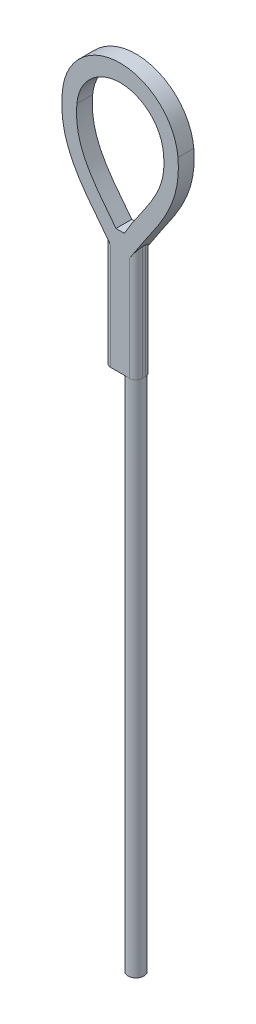
ISO-10303-21;
HEADER;
FILE_DESCRIPTION(('STEP AP214'),'2;1');
FILE_NAME('part.step','',(''),(''),'','','');
FILE_SCHEMA(('AUTOMOTIVE_DESIGN { 1 0 10303 214 1 1 1 1 }'));
ENDSEC;
DATA;
#1=APPLICATION_CONTEXT('core data for automotive mechanical design processes');
#2=APPLICATION_PROTOCOL_DEFINITION('international standard','automotive_design',2000,#1);
#3=PRODUCT_CONTEXT('',#1,'mechanical');
#4=PRODUCT('Part','Part','',(#3));
#5=PRODUCT_RELATED_PRODUCT_CATEGORY('part','',(#4));
#6=PRODUCT_DEFINITION_FORMATION('','',#4);
#7=PRODUCT_DEFINITION_CONTEXT('part definition',#1,'design');
#8=PRODUCT_DEFINITION('design','',#6,#7);
#9=PRODUCT_DEFINITION_SHAPE('','',#8);
#10=(LENGTH_UNIT() NAMED_UNIT(*) SI_UNIT(.MILLI.,.METRE.));
#11=(NAMED_UNIT(*) PLANE_ANGLE_UNIT() SI_UNIT($,.RADIAN.));
#12=(NAMED_UNIT(*) SI_UNIT($,.STERADIAN.) SOLID_ANGLE_UNIT());
#13=UNCERTAINTY_MEASURE_WITH_UNIT(LENGTH_MEASURE(1.E-05),#10,'distance_accuracy_value','');
#14=(GEOMETRIC_REPRESENTATION_CONTEXT(3) GLOBAL_UNCERTAINTY_ASSIGNED_CONTEXT((#13)) GLOBAL_UNIT_ASSIGNED_CONTEXT((#10,
#11,#12)) REPRESENTATION_CONTEXT('',''));
#15=CARTESIAN_POINT('',(0.,0.,0.));
#16=DIRECTION('',(0.,0.,1.));
#17=DIRECTION('',(1.,0.,0.));
#18=AXIS2_PLACEMENT_3D('',#15,#16,#17);
#19=CARTESIAN_POINT('',(0.,50.8,0.));
#20=DIRECTION('',(0.,-1.,0.));
#21=DIRECTION('',(0.,0.,-1.));
#22=AXIS2_PLACEMENT_3D('',#19,#20,#21);
#23=CYLINDRICAL_SURFACE('',#22,0.635);
#24=CARTESIAN_POINT('',(0.,0.,0.));
#25=DIRECTION('',(0.,1.,0.));
#26=DIRECTION('',(0.,0.,1.));
#27=AXIS2_PLACEMENT_3D('',#24,#25,#26);
#28=CIRCLE('',#27,0.635);
#29=CARTESIAN_POINT('',(0.,0.,0.635));
#30=VERTEX_POINT('',#29);
#31=EDGE_CURVE('E263',#30,#30,#28,.T.);
#32=ORIENTED_EDGE('',*,*,#31,.T.);
#33=EDGE_LOOP('',(#32));
#34=FACE_BOUND('',#33,.T.);
#35=CARTESIAN_POINT('',(0.,41.6415791346162,0.));
#36=DIRECTION('',(0.,1.,0.));
#37=DIRECTION('',(0.,0.,1.));
#38=AXIS2_PLACEMENT_3D('',#35,#36,#37);
#39=CIRCLE('',#38,0.635);
#40=CARTESIAN_POINT('',(0.635,41.6415791346162,0.));
#41=VERTEX_POINT('',#40);
#42=CARTESIAN_POINT('',(0.,41.6415791346162,-0.635));
#43=VERTEX_POINT('',#42);
#44=EDGE_CURVE('E268',#41,#43,#39,.T.);
#45=ORIENTED_EDGE('',*,*,#44,.F.);
#46=CARTESIAN_POINT('',(0.,41.6415791346162,0.635));
#47=VERTEX_POINT('',#46);
#48=EDGE_CURVE('E270',#47,#41,#39,.T.);
#49=ORIENTED_EDGE('',*,*,#48,.F.);
#50=EDGE_CURVE('E272',#43,#47,#39,.T.);
#51=ORIENTED_EDGE('',*,*,#50,.F.);
#52=EDGE_LOOP('',(#45,#49,#51));
#53=FACE_BOUND('',#52,.T.);
#54=ADVANCED_FACE('F33',(#34,#53),#23,.T.);
#55=CARTESIAN_POINT('',(0.,0.,0.));
#56=DIRECTION('',(0.,1.,0.));
#57=DIRECTION('',(0.,0.,1.));
#58=AXIS2_PLACEMENT_3D('',#55,#56,#57);
#59=PLANE('',#58);
#60=ORIENTED_EDGE('',*,*,#31,.F.);
#61=EDGE_LOOP('',(#60));
#62=FACE_BOUND('',#61,.T.);
#63=ADVANCED_FACE('F220',(#62),#59,.F.);
#64=CARTESIAN_POINT('',(0.,41.6415791346162,0.635));
#65=DIRECTION('',(0.,1.,0.));
#66=DIRECTION('',(0.,0.,1.));
#67=AXIS2_PLACEMENT_3D('',#64,#65,#66);
#68=PLANE('',#67);
#69=DIRECTION('',(0.,0.,-1.));
#70=VECTOR('',#69,1.);
#71=CARTESIAN_POINT('',(0.635,41.6415791346162,0.635));
#72=LINE('',#71,#70);
#73=CARTESIAN_POINT('',(0.635,41.6415791346162,0.127));
#74=VERTEX_POINT('',#73);
#75=EDGE_CURVE('E282',#74,#41,#72,.T.);
#76=ORIENTED_EDGE('',*,*,#75,.F.);
#77=CARTESIAN_POINT('',(0.127,41.6415791346162,0.127));
#78=DIRECTION('',(0.,1.,0.));
#79=DIRECTION('',(0.,0.,1.));
#80=AXIS2_PLACEMENT_3D('',#77,#78,#79);
#81=CIRCLE('',#80,0.508);
#82=CARTESIAN_POINT('',(0.127,41.6415791346162,0.635));
#83=VERTEX_POINT('',#82);
#84=EDGE_CURVE('E326',#74,#83,#81,.F.);
#85=ORIENTED_EDGE('',*,*,#84,.T.);
#86=DIRECTION('',(1.,0.,0.));
#87=VECTOR('',#86,1.);
#88=CARTESIAN_POINT('',(0.,41.6415791346162,0.635));
#89=LINE('',#88,#87);
#90=EDGE_CURVE('E204',#47,#83,#89,.T.);
#91=ORIENTED_EDGE('',*,*,#90,.F.);
#92=ORIENTED_EDGE('',*,*,#48,.T.);
#93=EDGE_LOOP('',(#76,#85,#91,#92));
#94=FACE_BOUND('',#93,.T.);
#95=ADVANCED_FACE('F258',(#94),#68,.F.);
#96=DIRECTION('',(1.,0.,0.));
#97=VECTOR('',#96,1.);
#98=CARTESIAN_POINT('',(0.,41.6415791346162,-0.635));
#99=LINE('',#98,#97);
#100=CARTESIAN_POINT('',(0.127,41.6415791346162,-0.635));
#101=VERTEX_POINT('',#100);
#102=EDGE_CURVE('E337',#43,#101,#99,.T.);
#103=ORIENTED_EDGE('',*,*,#102,.T.);
#104=CARTESIAN_POINT('',(0.127,41.6415791346162,-0.127));
#105=DIRECTION('',(0.,1.,0.));
#106=DIRECTION('',(0.,0.,1.));
#107=AXIS2_PLACEMENT_3D('',#104,#105,#106);
#108=CIRCLE('',#107,0.508);
#109=CARTESIAN_POINT('',(0.635,41.6415791346162,-0.127));
#110=VERTEX_POINT('',#109);
#111=EDGE_CURVE('E289',#101,#110,#108,.F.);
#112=ORIENTED_EDGE('',*,*,#111,.T.);
#113=EDGE_CURVE('E286',#41,#110,#72,.T.);
#114=ORIENTED_EDGE('',*,*,#113,.F.);
#115=ORIENTED_EDGE('',*,*,#44,.T.);
#116=EDGE_LOOP('',(#103,#112,#114,#115));
#117=FACE_BOUND('',#116,.T.);
#118=ADVANCED_FACE('F287',(#117),#68,.F.);
#119=CARTESIAN_POINT('',(0.635,0.,0.635));
#120=DIRECTION('',(-1.,0.,0.));
#121=DIRECTION('',(0.,0.,1.));
#122=AXIS2_PLACEMENT_3D('',#119,#120,#121);
#123=PLANE('',#122);
#124=ORIENTED_EDGE('',*,*,#113,.T.);
#125=DIRECTION('',(0.,1.,0.));
#126=VECTOR('',#125,1.);
#127=CARTESIAN_POINT('',(0.635,0.,-0.127));
#128=LINE('',#127,#126);
#129=CARTESIAN_POINT('',(0.635,50.8,-0.127));
#130=VERTEX_POINT('',#129);
#131=EDGE_CURVE('E319',#110,#130,#128,.T.);
#132=ORIENTED_EDGE('',*,*,#131,.T.);
#133=DIRECTION('',(0.,0.,-1.));
#134=VECTOR('',#133,1.);
#135=CARTESIAN_POINT('',(0.635,50.8,0.635));
#136=LINE('',#135,#134);
#137=CARTESIAN_POINT('',(0.635,50.8,0.127));
#138=VERTEX_POINT('',#137);
#139=EDGE_CURVE('E155',#138,#130,#136,.T.);
#140=ORIENTED_EDGE('',*,*,#139,.F.);
#141=DIRECTION('',(0.,1.,0.));
#142=VECTOR('',#141,1.);
#143=CARTESIAN_POINT('',(0.635,41.6415791346162,0.127));
#144=LINE('',#143,#142);
#145=EDGE_CURVE('E317',#138,#74,#144,.F.);
#146=ORIENTED_EDGE('',*,*,#145,.T.);
#147=ORIENTED_EDGE('',*,*,#75,.T.);
#148=EDGE_LOOP('',(#124,#132,#140,#146,#147));
#149=FACE_BOUND('',#148,.T.);
#150=ADVANCED_FACE('F345',(#149),#123,.F.);
#151=CARTESIAN_POINT('',(0.,51.5217847654651,0.635));
#152=DIRECTION('',(0.,-1.,0.));
#153=DIRECTION('',(0.,0.,-1.));
#154=AXIS2_PLACEMENT_3D('',#151,#152,#153);
#155=PLANE('',#154);
#156=DIRECTION('',(0.,0.,-1.));
#157=VECTOR('',#156,1.);
#158=CARTESIAN_POINT('',(-0.297199842452705,51.5217847654651,0.635));
#159=LINE('',#158,#157);
#160=CARTESIAN_POINT('',(-0.297199842452705,51.5217847654651,0.635));
#161=VERTEX_POINT('',#160);
#162=CARTESIAN_POINT('',(-0.297199842452705,51.5217847654651,-0.635));
#163=VERTEX_POINT('',#162);
#164=EDGE_CURVE('E302',#161,#163,#159,.T.);
#165=ORIENTED_EDGE('',*,*,#164,.T.);
#166=DIRECTION('',(-1.,0.,0.));
#167=VECTOR('',#166,1.);
#168=CARTESIAN_POINT('',(0.,51.5217847654651,-0.635));
#169=LINE('',#168,#167);
#170=CARTESIAN_POINT('',(-0.972800157547294,51.5217847654651,-0.635));
#171=VERTEX_POINT('',#170);
#172=EDGE_CURVE('E173',#163,#171,#169,.T.);
#173=ORIENTED_EDGE('',*,*,#172,.T.);
#174=DIRECTION('',(0.,0.,-1.));
#175=VECTOR('',#174,1.);
#176=CARTESIAN_POINT('',(-0.972800157547294,51.5217847654651,0.635));
#177=LINE('',#176,#175);
#178=CARTESIAN_POINT('',(-0.972800157547294,51.5217847654651,0.635));
#179=VERTEX_POINT('',#178);
#180=EDGE_CURVE('E303',#179,#171,#177,.T.);
#181=ORIENTED_EDGE('',*,*,#180,.F.);
#182=DIRECTION('',(-1.,0.,0.));
#183=VECTOR('',#182,1.);
#184=CARTESIAN_POINT('',(0.,51.5217847654651,0.635));
#185=LINE('',#184,#183);
#186=EDGE_CURVE('E352',#161,#179,#185,.T.);
#187=ORIENTED_EDGE('',*,*,#186,.F.);
#188=EDGE_LOOP('',(#165,#173,#181,#187));
#189=FACE_BOUND('',#188,.T.);
#190=ADVANCED_FACE('F368',(#189),#155,.F.);
#191=CARTESIAN_POINT('',(-0.972800157547294,51.5217847654651,0.635));
#192=CARTESIAN_POINT('',(-1.19864409421132,51.8134668461217,0.635));
#193=CARTESIAN_POINT('',(-1.66340872920472,52.4026008443346,0.635));
#194=CARTESIAN_POINT('',(-2.51767104414131,53.5118884946644,0.635));
#195=CARTESIAN_POINT('',(-3.24002687549235,54.5943109455933,0.635));
#196=CARTESIAN_POINT('',(-3.74932845143101,55.707645055064,0.635));
#197=CARTESIAN_POINT('',(-4.01634926198818,56.5836676237724,0.635));
#198=CARTESIAN_POINT('',(-4.13205867970765,57.3808776525529,0.635));
#199=CARTESIAN_POINT('',(-4.15049621503154,58.0713831145432,0.635));
#200=CARTESIAN_POINT('',(-4.13112479757282,58.4518746606127,0.635));
#201=CARTESIAN_POINT('',(-4.1148797619978,58.6370122069561,0.635));
#202=B_SPLINE_CURVE_WITH_KNOTS('',3,(#191,#192,#193,#194,#195,#196,#197,#198,#199,#200,#201),
.UNSPECIFIED.,.F.,.F.,(4,1,1,1,1,1,1,1,4),(0.,0.125,0.25,0.5,0.625,0.75,0.875,0.9375,1.),.UNSPECIFIED.);
#203=DIRECTION('',(0.,0.,-1.));
#204=VECTOR('',#203,1.);
#205=SURFACE_OF_LINEAR_EXTRUSION('',#202,#204);
#206=ORIENTED_EDGE('',*,*,#180,.T.);
#207=CARTESIAN_POINT('',(-0.972800157547294,51.5217847654651,-0.635));
#208=CARTESIAN_POINT('',(-1.19864409421132,51.8134668461217,-0.635));
#209=CARTESIAN_POINT('',(-1.66340872920472,52.4026008443346,-0.635));
#210=CARTESIAN_POINT('',(-2.51767104414131,53.5118884946644,-0.635));
#211=CARTESIAN_POINT('',(-3.24002687549235,54.5943109455933,-0.635));
#212=CARTESIAN_POINT('',(-3.74932845143101,55.707645055064,-0.635));
#213=CARTESIAN_POINT('',(-4.01634926198818,56.5836676237724,-0.635));
#214=CARTESIAN_POINT('',(-4.13205867970765,57.3808776525529,-0.635));
#215=CARTESIAN_POINT('',(-4.15049621503154,58.0713831145432,-0.635));
#216=CARTESIAN_POINT('',(-4.13112479757282,58.4518746606127,-0.635));
#217=CARTESIAN_POINT('',(-4.1148797619978,58.6370122069561,-0.635));
#218=B_SPLINE_CURVE_WITH_KNOTS('',3,(#207,#208,#209,#210,#211,#212,#213,#214,#215,#216,#217),
.UNSPECIFIED.,.F.,.F.,(4,1,1,1,1,1,1,1,4),(0.,0.125,0.25,0.5,0.625,0.75,0.875,0.9375,1.),.UNSPECIFIED.);
#219=CARTESIAN_POINT('',(-4.1148797619978,58.6370122069561,-0.635));
#220=VERTEX_POINT('',#219);
#221=EDGE_CURVE('E176',#171,#220,#218,.T.);
#222=ORIENTED_EDGE('',*,*,#221,.T.);
#223=DIRECTION('',(0.,0.,-1.));
#224=VECTOR('',#223,1.);
#225=CARTESIAN_POINT('',(-4.1148797619978,58.6370122069561,0.635));
#226=LINE('',#225,#224);
#227=CARTESIAN_POINT('',(-4.1148797619978,58.6370122069561,0.635));
#228=VERTEX_POINT('',#227);
#229=EDGE_CURVE('E491',#228,#220,#226,.T.);
#230=ORIENTED_EDGE('',*,*,#229,.F.);
#231=EDGE_CURVE('E499',#179,#228,#202,.T.);
#232=ORIENTED_EDGE('',*,*,#231,.F.);
#233=EDGE_LOOP('',(#206,#222,#230,#232));
#234=FACE_BOUND('',#233,.T.);
#235=ADVANCED_FACE('F390',(#234),#205,.F.);
#236=CARTESIAN_POINT('',(-0.635,58.3403759110681,0.635));
#237=DIRECTION('',(0.,0.,-1.));
#238=DIRECTION('',(-1.,0.,0.));
#239=AXIS2_PLACEMENT_3D('',#236,#237,#238);
#240=CYLINDRICAL_SURFACE('',#239,3.4925);
#241=ORIENTED_EDGE('',*,*,#229,.T.);
#242=CARTESIAN_POINT('',(-0.635,58.3403759110681,-0.635));
#243=DIRECTION('',(0.,0.,1.));
#244=DIRECTION('',(1.,0.,0.));
#245=AXIS2_PLACEMENT_3D('',#242,#243,#244);
#246=CIRCLE('',#245,3.4925);
#247=CARTESIAN_POINT('',(2.8448797619978,58.6370122069561,-0.635));
#248=VERTEX_POINT('',#247);
#249=EDGE_CURVE('E186',#248,#220,#246,.T.);
#250=ORIENTED_EDGE('',*,*,#249,.F.);
#251=DIRECTION('',(0.,0.,-1.));
#252=VECTOR('',#251,1.);
#253=CARTESIAN_POINT('',(2.8448797619978,58.6370122069561,0.635));
#254=LINE('',#253,#252);
#255=CARTESIAN_POINT('',(2.8448797619978,58.6370122069561,0.635));
#256=VERTEX_POINT('',#255);
#257=EDGE_CURVE('E489',#256,#248,#254,.T.);
#258=ORIENTED_EDGE('',*,*,#257,.F.);
#259=CARTESIAN_POINT('',(-0.635,58.3403759110681,0.635));
#260=DIRECTION('',(0.,0.,1.));
#261=DIRECTION('',(1.,0.,0.));
#262=AXIS2_PLACEMENT_3D('',#259,#260,#261);
#263=CIRCLE('',#262,3.4925);
#264=EDGE_CURVE('E483',#256,#228,#263,.T.);
#265=ORIENTED_EDGE('',*,*,#264,.T.);
#266=EDGE_LOOP('',(#241,#250,#258,#265));
#267=FACE_BOUND('',#266,.T.);
#268=ADVANCED_FACE('F217',(#267),#240,.F.);
#269=CARTESIAN_POINT('',(19.8549316381049,22.6966015696513,0.635));
#270=CARTESIAN_POINT('',(12.60162109207,32.0644010464342,0.635));
#271=CARTESIAN_POINT('',(5.34831054603498,41.4322005232171,0.635));
#272=CARTESIAN_POINT('',(-1.905,50.8,0.635));
#273=CARTESIAN_POINT('',(-3.71832763650874,53.1419498691957,0.635));
#274=CARTESIAN_POINT('',(-5.59859358814016,55.215603829298,0.635));
#275=CARTESIAN_POINT('',(-5.2893369727821,58.7400658530012,0.635));
#276=B_SPLINE_CURVE_WITH_KNOTS('',3,(#269,#270,#271,#272,#273,#274,#275),.UNSPECIFIED.,.F.,.F.,
(4,3,4),(-4.,0.,1.),.UNSPECIFIED.);
#277=DIRECTION('',(0.,0.,-1.));
#278=VECTOR('',#277,1.);
#279=SURFACE_OF_LINEAR_EXTRUSION('',#276,#278);
#280=DIRECTION('',(0.,0.,-1.));
#281=VECTOR('',#280,1.);
#282=CARTESIAN_POINT('',(-5.2893369727821,58.7400658530012,0.635));
#283=LINE('',#282,#281);
#284=CARTESIAN_POINT('',(-5.2893369727821,58.7400658530012,0.635));
#285=VERTEX_POINT('',#284);
#286=CARTESIAN_POINT('',(-5.2893369727821,58.7400658530012,-0.635));
#287=VERTEX_POINT('',#286);
#288=EDGE_CURVE('E156',#285,#287,#283,.T.);
#289=ORIENTED_EDGE('',*,*,#288,.T.);
#290=CARTESIAN_POINT('',(19.8549316381049,22.6966015696513,-0.635));
#291=CARTESIAN_POINT('',(12.60162109207,32.0644010464342,-0.635));
#292=CARTESIAN_POINT('',(5.34831054603498,41.4322005232171,-0.635));
#293=CARTESIAN_POINT('',(-1.905,50.8,-0.635));
#294=CARTESIAN_POINT('',(-3.71832763650874,53.1419498691957,-0.635));
#295=CARTESIAN_POINT('',(-5.59859358814016,55.215603829298,-0.635));
#296=CARTESIAN_POINT('',(-5.2893369727821,58.7400658530012,-0.635));
#297=B_SPLINE_CURVE_WITH_KNOTS('',3,(#290,#291,#292,#293,#294,#295,#296),.UNSPECIFIED.,.F.,.F.,
(4,3,4),(-4.,0.,1.),.UNSPECIFIED.);
#298=CARTESIAN_POINT('',(-1.397,50.1439075710322,-0.635));
#299=VERTEX_POINT('',#298);
#300=EDGE_CURVE('E172',#299,#287,#297,.T.);
#301=ORIENTED_EDGE('',*,*,#300,.F.);
#302=CARTESIAN_POINT('',(-1.397,50.1439075710322,-0.635));
#303=CARTESIAN_POINT('',(-1.41948053711744,50.1729416462328,-0.634985105061291));
#304=CARTESIAN_POINT('',(-1.44196707495412,50.2019834714854,-0.633506605465534));
#305=CARTESIAN_POINT('',(-1.48685005869762,50.2599507664137,-0.627508969615712));
#306=CARTESIAN_POINT('',(-1.5092460753983,50.2888756817609,-0.622981321988728));
#307=CARTESIAN_POINT('',(-1.55398348181977,50.3466549605892,-0.610697961675404));
#308=CARTESIAN_POINT('',(-1.57632102797772,50.3755043600301,-0.602904359522409));
#309=CARTESIAN_POINT('',(-1.62041361364104,50.4324508396114,-0.583866142368023));
#310=CARTESIAN_POINT('',(-1.64216940331753,50.4605488886132,-0.57262623035196));
#311=CARTESIAN_POINT('',(-1.68486134833098,50.5156864120408,-0.546321295737716));
#312=CARTESIAN_POINT('',(-1.70579566139771,50.5427235071368,-0.531248185984284));
#313=CARTESIAN_POINT('',(-1.74627206187294,50.5949996093094,-0.496833770610507));
#314=CARTESIAN_POINT('',(-1.76581776695678,50.620243288688,-0.477504137354492));
#315=CARTESIAN_POINT('',(-1.7987281226753,50.6627476887304,-0.438730154195163));
#316=CARTESIAN_POINT('',(-1.81250924604485,50.6805462924813,-0.420237081650348));
#317=CARTESIAN_POINT('',(-1.83817263027838,50.7136910800744,-0.379979146217854));
#318=CARTESIAN_POINT('',(-1.8500575713296,50.7290407254336,-0.358218987282367));
#319=CARTESIAN_POINT('',(-1.8680251846669,50.7522462669242,-0.318134249505664));
#320=CARTESIAN_POINT('',(-1.87479229527409,50.7609861291985,-0.300632288980688));
#321=CARTESIAN_POINT('',(-1.88652062655429,50.7761335098232,-0.264111526442764));
#322=CARTESIAN_POINT('',(-1.89148715496952,50.7825478832317,-0.245097387449928));
#323=CARTESIAN_POINT('',(-1.89848689910641,50.7915881964854,-0.209668625233864));
#324=CARTESIAN_POINT('',(-1.90090008522349,50.7947048758971,-0.193455193606867));
#325=CARTESIAN_POINT('',(-1.90417047524478,50.7989286517489,-0.16050678328931));
#326=CARTESIAN_POINT('',(-1.90501707089032,50.8000220474053,-0.143769023751794));
#327=CARTESIAN_POINT('',(-1.905,50.8,-0.126999999999998));
#328=B_SPLINE_CURVE_WITH_KNOTS('',3,(#302,#303,#304,#305,#306,#307,#308,#309,#310,#311,#312,
#313,#314,#315,#316,#317,#318,#319,#320,#321,#322,#323,#324,#325,#326,#327),.UNSPECIFIED.,.F.,
.F.,(4,2,2,2,2,2,2,2,2,2,2,2,4),(0.,0.110145936586624,0.220600615308452,0.332373834277486,
0.443995196416449,0.555854036171403,0.66740987077369,0.754546864282199,0.841559580152677,
0.903443993412277,0.965144471833589,1.01500684292743,1.06520564151606),.UNSPECIFIED.);
#329=CARTESIAN_POINT('',(-1.905,50.8,-0.127));
#330=VERTEX_POINT('',#329);
#331=EDGE_CURVE('E224',#299,#330,#328,.T.);
#332=ORIENTED_EDGE('',*,*,#331,.T.);
#333=DIRECTION('',(0.,0.,-1.));
#334=VECTOR('',#333,1.);
#335=CARTESIAN_POINT('',(-1.905,50.8,0.635));
#336=LINE('',#335,#334);
#337=CARTESIAN_POINT('',(-1.905,50.8,0.127));
#338=VERTEX_POINT('',#337);
#339=EDGE_CURVE('E299',#338,#330,#336,.T.);
#340=ORIENTED_EDGE('',*,*,#339,.F.);
#341=CARTESIAN_POINT('',(-1.905,50.8,0.127));
#342=CARTESIAN_POINT('',(-1.90500193678054,50.8000025013918,0.137553519854215));
#343=CARTESIAN_POINT('',(-1.90467082289866,50.7995748610158,0.14809941980043));
#344=CARTESIAN_POINT('',(-1.90336340673133,50.7978863061951,0.16907163451003));
#345=CARTESIAN_POINT('',(-1.90238787555687,50.7966263876562,0.179498077065008));
#346=CARTESIAN_POINT('',(-1.89855647736993,50.7916780582412,0.210225374839537));
#347=CARTESIAN_POINT('',(-1.89479465495277,50.7868195873612,0.230238524575559));
#348=CARTESIAN_POINT('',(-1.885222534396,50.7744569971517,0.268763705218873));
#349=CARTESIAN_POINT('',(-1.87942128474835,50.7669645641352,0.287281929634138));
#350=CARTESIAN_POINT('',(-1.86616708481839,50.749846492824,0.322717479356907));
#351=CARTESIAN_POINT('',(-1.8587090033068,50.7402142274413,0.339629593039884));
#352=CARTESIAN_POINT('',(-1.83820434844432,50.7137320447368,0.380306324072441));
#353=CARTESIAN_POINT('',(-1.82429930124585,50.6957733908169,0.402912004586183));
#354=CARTESIAN_POINT('',(-1.79452350111529,50.6573173336671,0.444319274863479));
#355=CARTESIAN_POINT('',(-1.7786486901795,50.6368146894422,0.463112794041724));
#356=CARTESIAN_POINT('',(-1.73608967533073,50.5818488480512,0.507114081783113));
#357=CARTESIAN_POINT('',(-1.70843421395562,50.5461312519334,0.529805556026583));
#358=CARTESIAN_POINT('',(-1.65132020838271,50.4723673412161,0.568100799815563));
#359=CARTESIAN_POINT('',(-1.62185593261901,50.4343136241815,0.58368056372671));
#360=CARTESIAN_POINT('',(-1.55993384224704,50.3543399732387,0.609403925870971));
#361=CARTESIAN_POINT('',(-1.52740815539603,50.3123323809357,0.619110019456842));
#362=CARTESIAN_POINT('',(-1.47845791010411,50.2491121342189,0.628697823235574));
#363=CARTESIAN_POINT('',(-1.4621965818156,50.228110294898,0.631065549800225));
#364=CARTESIAN_POINT('',(-1.42962504236851,50.1860434830258,0.634214298125644));
#365=CARTESIAN_POINT('',(-1.4133148622672,50.1649785505857,0.634996174077998));
#366=CARTESIAN_POINT('',(-1.39699999999999,50.1439075710322,0.635));
#367=B_SPLINE_CURVE_WITH_KNOTS('',3,(#341,#342,#343,#344,#345,#346,#347,#348,#349,#350,#351,
#352,#353,#354,#355,#356,#357,#358,#359,#360,#361,#362,#363,#364,#365,#366),.UNSPECIFIED.,.F.,
.F.,(4,2,2,2,2,2,2,2,2,2,2,2,4),(0.,0.0316325930213611,0.0632274028200183,0.125638088370931,
0.187775295182176,0.250107693118476,0.345701016302428,0.441494651589904,0.592312104595091,
0.743634945401952,0.905163610390449,0.98512573205975,1.06504477203569),.UNSPECIFIED.);
#368=CARTESIAN_POINT('',(-1.397,50.1439075710322,0.635));
#369=VERTEX_POINT('',#368);
#370=EDGE_CURVE('E47',#338,#369,#367,.T.);
#371=ORIENTED_EDGE('',*,*,#370,.T.);
#372=EDGE_CURVE('E54',#369,#285,#276,.T.);
#373=ORIENTED_EDGE('',*,*,#372,.T.);
#374=EDGE_LOOP('',(#289,#301,#332,#340,#371,#373));
#375=FACE_BOUND('',#374,.T.);
#376=ADVANCED_FACE('F211',(#375),#279,.T.);
#377=CARTESIAN_POINT('',(-1.905,0.,0.635));
#378=DIRECTION('',(-1.,0.,0.));
#379=DIRECTION('',(0.,0.,1.));
#380=AXIS2_PLACEMENT_3D('',#377,#378,#379);
#381=PLANE('',#380);
#382=ORIENTED_EDGE('',*,*,#339,.T.);
#383=DIRECTION('',(0.,1.,0.));
#384=VECTOR('',#383,1.);
#385=CARTESIAN_POINT('',(-1.905,41.6415791346162,-0.127));
#386=LINE('',#385,#384);
#387=CARTESIAN_POINT('',(-1.905,41.6415791346162,-0.127));
#388=VERTEX_POINT('',#387);
#389=EDGE_CURVE('E311',#330,#388,#386,.F.);
#390=ORIENTED_EDGE('',*,*,#389,.T.);
#391=DIRECTION('',(0.,0.,-1.));
#392=VECTOR('',#391,1.);
#393=CARTESIAN_POINT('',(-1.905,41.6415791346162,0.635));
#394=LINE('',#393,#392);
#395=CARTESIAN_POINT('',(-1.905,41.6415791346162,0.127));
#396=VERTEX_POINT('',#395);
#397=EDGE_CURVE('E294',#396,#388,#394,.T.);
#398=ORIENTED_EDGE('',*,*,#397,.F.);
#399=DIRECTION('',(0.,1.,0.));
#400=VECTOR('',#399,1.);
#401=CARTESIAN_POINT('',(-1.905,0.,0.127));
#402=LINE('',#401,#400);
#403=EDGE_CURVE('E308',#396,#338,#402,.T.);
#404=ORIENTED_EDGE('',*,*,#403,.T.);
#405=EDGE_LOOP('',(#382,#390,#398,#404));
#406=FACE_BOUND('',#405,.T.);
#407=ADVANCED_FACE('F216',(#406),#381,.T.);
#408=ORIENTED_EDGE('',*,*,#397,.T.);
#409=CARTESIAN_POINT('',(-1.397,41.6415791346162,-0.127));
#410=DIRECTION('',(0.,1.,0.));
#411=DIRECTION('',(0.,0.,1.));
#412=AXIS2_PLACEMENT_3D('',#409,#410,#411);
#413=CIRCLE('',#412,0.508);
#414=CARTESIAN_POINT('',(-1.397,41.6415791346162,-0.635));
#415=VERTEX_POINT('',#414);
#416=EDGE_CURVE('E315',#388,#415,#413,.F.);
#417=ORIENTED_EDGE('',*,*,#416,.T.);
#418=EDGE_CURVE('E165',#415,#43,#99,.T.);
#419=ORIENTED_EDGE('',*,*,#418,.T.);
#420=ORIENTED_EDGE('',*,*,#50,.T.);
#421=CARTESIAN_POINT('',(-1.397,41.6415791346162,0.635));
#422=VERTEX_POINT('',#421);
#423=EDGE_CURVE('E205',#422,#47,#89,.T.);
#424=ORIENTED_EDGE('',*,*,#423,.F.);
#425=CARTESIAN_POINT('',(-1.397,41.6415791346162,0.127));
#426=DIRECTION('',(0.,1.,0.));
#427=DIRECTION('',(0.,0.,1.));
#428=AXIS2_PLACEMENT_3D('',#425,#426,#427);
#429=CIRCLE('',#428,0.508);
#430=EDGE_CURVE('E313',#422,#396,#429,.F.);
#431=ORIENTED_EDGE('',*,*,#430,.T.);
#432=EDGE_LOOP('',(#408,#417,#419,#420,#424,#431));
#433=FACE_BOUND('',#432,.T.);
#434=ADVANCED_FACE('F336',(#433),#68,.F.);
#435=CARTESIAN_POINT('',(-18.8391299344956,20.6610322319702,0.635));
#436=CARTESIAN_POINT('',(-12.3477532896637,30.7073548213135,0.635));
#437=CARTESIAN_POINT('',(-5.85637664483186,40.7536774106567,0.635));
#438=CARTESIAN_POINT('',(0.635,50.8,0.635));
#439=CARTESIAN_POINT('',(2.25784416120797,53.3115806473358,0.635));
#440=CARTESIAN_POINT('',(4.31499086994632,55.4243709701665,0.635));
#441=CARTESIAN_POINT('',(4.00573425458827,58.9488329938697,0.635));
#442=B_SPLINE_CURVE_WITH_KNOTS('',3,(#435,#436,#437,#438,#439,#440,#441),.UNSPECIFIED.,.F.,.F.,
(4,3,4),(-4.,0.,1.),.UNSPECIFIED.);
#443=DIRECTION('',(0.,0.,-1.));
#444=VECTOR('',#443,1.);
#445=SURFACE_OF_LINEAR_EXTRUSION('',#442,#444);
#446=CARTESIAN_POINT('',(0.127000000000008,50.0137982196042,0.635));
#447=VERTEX_POINT('',#446);
#448=CARTESIAN_POINT('',(4.00573425458827,58.9488329938697,0.635));
#449=VERTEX_POINT('',#448);
#450=EDGE_CURVE('E61',#447,#449,#442,.T.);
#451=ORIENTED_EDGE('',*,*,#450,.F.);
#452=CARTESIAN_POINT('',(0.127,50.0137982196042,0.635));
#453=CARTESIAN_POINT('',(0.150269252037833,50.0498106750779,0.634978736861889));
#454=CARTESIAN_POINT('',(0.173545522588611,50.0858339926921,0.633399535363202));
#455=CARTESIAN_POINT('',(0.22003111088537,50.1577770089945,0.626967397858313));
#456=CARTESIAN_POINT('',(0.243240039468896,50.1936961053989,0.622104993498531));
#457=CARTESIAN_POINT('',(0.289486458107902,50.2652689728614,0.608914730037593));
#458=CARTESIAN_POINT('',(0.312522551093845,50.3009205817569,0.60057000888784));
#459=CARTESIAN_POINT('',(0.358074011260319,50.3714179027854,0.580092445993644));
#460=CARTESIAN_POINT('',(0.380590017960376,50.4062646046653,0.567964555369246));
#461=CARTESIAN_POINT('',(0.419103586930428,50.4658697946135,0.54307744440167));
#462=CARTESIAN_POINT('',(0.435285044282733,50.4909128863059,0.531287182627213));
#463=CARTESIAN_POINT('',(0.467001316140757,50.5399982985152,0.505004831225333));
#464=CARTESIAN_POINT('',(0.48253608718118,50.5640405517632,0.490512560347093));
#465=CARTESIAN_POINT('',(0.512765347808835,50.6108246039788,0.458273904693862));
#466=CARTESIAN_POINT('',(0.527451722629553,50.6335538441985,0.440501316628109));
#467=CARTESIAN_POINT('',(0.555280226872084,50.6766223866813,0.401256597625021));
#468=CARTESIAN_POINT('',(0.568426932353288,50.6969687710428,0.379795922772063));
#469=CARTESIAN_POINT('',(0.587506057868869,50.7264964136585,0.342055990390644));
#470=CARTESIAN_POINT('',(0.594223019684944,50.7368918611755,0.32712951248973));
#471=CARTESIAN_POINT('',(0.606475689588404,50.7558545991532,0.29567606461894));
#472=CARTESIAN_POINT('',(0.612011131918706,50.7644214783173,0.279148735785282));
#473=CARTESIAN_POINT('',(0.621585155618377,50.779238632802,0.244382643057663));
#474=CARTESIAN_POINT('',(0.62560351350533,50.785457609426,0.226124557589252));
#475=CARTESIAN_POINT('',(0.631613176173706,50.7947584115706,0.1885375280258));
#476=CARTESIAN_POINT('',(0.633612148522858,50.7978521037357,0.169212930651296));
#477=CARTESIAN_POINT('',(0.634832065434316,50.7997400975304,0.142176217238996));
#478=CARTESIAN_POINT('',(0.635004222642136,50.8000065351354,0.134586597984666));
#479=CARTESIAN_POINT('',(0.635,50.8,0.127));
#480=B_SPLINE_CURVE_WITH_KNOTS('',3,(#452,#453,#454,#455,#456,#457,#458,#459,#460,#461,#462,
#463,#464,#465,#466,#467,#468,#469,#470,#471,#472,#473,#474,#475,#476,#477,#478,#479),
.UNSPECIFIED.,.F.,.F.,(4,2,2,2,2,2,2,2,2,2,2,2,2,4),(0.,0.128620420574855,0.257613359885552,
0.387238291633048,0.516694287010589,0.612773293208543,0.70885874670816,0.805747849708387,
0.902341259044832,0.960364766133645,1.01840131062586,1.07718627250952,1.13574718046831,
1.15851057327769),.UNSPECIFIED.);
#481=EDGE_CURVE('E11',#447,#138,#480,.T.);
#482=ORIENTED_EDGE('',*,*,#481,.T.);
#483=ORIENTED_EDGE('',*,*,#139,.T.);
#484=CARTESIAN_POINT('',(0.635,50.8,-0.127));
#485=CARTESIAN_POINT('',(0.635021093558223,50.8000326452619,-0.143564870014353));
#486=CARTESIAN_POINT('',(0.634190889477879,50.7987477871397,-0.160081520161863));
#487=CARTESIAN_POINT('',(0.631019791457731,50.7938400648774,-0.192453248540243));
#488=CARTESIAN_POINT('',(0.628693914872337,50.7902404422152,-0.208313253186344));
#489=CARTESIAN_POINT('',(0.622060230348277,50.7799738780746,-0.242536859891795));
#490=CARTESIAN_POINT('',(0.617429287867917,50.7728068402341,-0.260685110420569));
#491=CARTESIAN_POINT('',(0.606623870887798,50.756083930652,-0.29539580321526));
#492=CARTESIAN_POINT('',(0.600443211557294,50.746518487011,-0.311951514366666));
#493=CARTESIAN_POINT('',(0.58359331930121,50.7204408978551,-0.351145700618194));
#494=CARTESIAN_POINT('',(0.572216006619296,50.7028328988656,-0.372742705846357));
#495=CARTESIAN_POINT('',(0.547834319355442,50.6650987926926,-0.412494373374666));
#496=CARTESIAN_POINT('',(0.534827022434066,50.6449681627758,-0.430642701797331));
#497=CARTESIAN_POINT('',(0.49791681786098,50.5878444057874,-0.476091780583826));
#498=CARTESIAN_POINT('',(0.472961046703377,50.5492218236707,-0.500468378719173));
#499=CARTESIAN_POINT('',(0.421353206694825,50.4693513990701,-0.54236217329642));
#500=CARTESIAN_POINT('',(0.394693450066034,50.4280916586637,-0.559845295059089));
#501=CARTESIAN_POINT('',(0.347925668304269,50.3557119081002,-0.584986260711329));
#502=CARTESIAN_POINT('',(0.328030012318182,50.3249205692057,-0.594023840838509));
#503=CARTESIAN_POINT('',(0.28791459378056,50.2628362907104,-0.609319144143231));
#504=CARTESIAN_POINT('',(0.267694625746106,50.2315430330958,-0.615575026436806));
#505=CARTESIAN_POINT('',(0.227420348568307,50.1692128984081,-0.625399987539047));
#506=CARTESIAN_POINT('',(0.207369177097229,50.1381808773262,-0.629013452544707));
#507=CARTESIAN_POINT('',(0.167211000136436,50.0760304241293,-0.63380587302275));
#508=CARTESIAN_POINT('',(0.147104123561138,50.0449121915276,-0.634988473137385));
#509=CARTESIAN_POINT('',(0.127000000000002,50.0137982196042,-0.635));
#510=B_SPLINE_CURVE_WITH_KNOTS('',3,(#484,#485,#486,#487,#488,#489,#490,#491,#492,#493,#494,
#495,#496,#497,#498,#499,#500,#501,#502,#503,#504,#505,#506,#507,#508,#509),.UNSPECIFIED.,.F.,
.F.,(4,2,2,2,2,2,2,2,2,2,2,2,4),(0.,0.0495459657207402,0.0986020701856896,0.158434259835903,
0.218509146691661,0.308297044625757,0.398248287054535,0.5535211895492,0.709552267590597,
0.822714243745141,0.935950997664857,1.04723898361712,1.15835999129445),.UNSPECIFIED.);
#511=CARTESIAN_POINT('',(0.127,50.0137982196042,-0.635));
#512=VERTEX_POINT('',#511);
#513=EDGE_CURVE('E162',#130,#512,#510,.T.);
#514=ORIENTED_EDGE('',*,*,#513,.T.);
#515=CARTESIAN_POINT('',(-18.8391299344956,20.6610322319702,-0.635));
#516=CARTESIAN_POINT('',(-12.3477532896637,30.7073548213135,-0.635));
#517=CARTESIAN_POINT('',(-5.85637664483186,40.7536774106567,-0.635));
#518=CARTESIAN_POINT('',(0.635,50.8,-0.635));
#519=CARTESIAN_POINT('',(2.25784416120797,53.3115806473358,-0.635));
#520=CARTESIAN_POINT('',(4.31499086994632,55.4243709701665,-0.635));
#521=CARTESIAN_POINT('',(4.00573425458827,58.9488329938697,-0.635));
#522=B_SPLINE_CURVE_WITH_KNOTS('',3,(#515,#516,#517,#518,#519,#520,#521),.UNSPECIFIED.,.F.,.F.,
(4,3,4),(-4.,0.,1.),.UNSPECIFIED.);
#523=CARTESIAN_POINT('',(4.00573425458827,58.9488329938697,-0.635));
#524=VERTEX_POINT('',#523);
#525=EDGE_CURVE('E159',#512,#524,#522,.T.);
#526=ORIENTED_EDGE('',*,*,#525,.T.);
#527=DIRECTION('',(0.,0.,-1.));
#528=VECTOR('',#527,1.);
#529=CARTESIAN_POINT('',(4.00573425458827,58.9488329938697,0.635));
#530=LINE('',#529,#528);
#531=EDGE_CURVE('E148',#449,#524,#530,.T.);
#532=ORIENTED_EDGE('',*,*,#531,.F.);
#533=EDGE_LOOP('',(#451,#482,#483,#514,#526,#532));
#534=FACE_BOUND('',#533,.T.);
#535=ADVANCED_FACE('F160',(#534),#445,.F.);
#536=CARTESIAN_POINT('',(-0.635,58.5416282180208,0.635));
#537=DIRECTION('',(0.,0.,-1.));
#538=DIRECTION('',(-1.,0.,0.));
#539=AXIS2_PLACEMENT_3D('',#536,#537,#538);
#540=CYLINDRICAL_SURFACE('',#539,4.658565245994);
#541=ORIENTED_EDGE('',*,*,#531,.T.);
#542=CARTESIAN_POINT('',(-0.635,58.5416282180208,-0.635));
#543=DIRECTION('',(0.,0.,1.));
#544=DIRECTION('',(1.,0.,0.));
#545=AXIS2_PLACEMENT_3D('',#542,#543,#544);
#546=CIRCLE('',#545,4.658565245994);
#547=EDGE_CURVE('E153',#524,#287,#546,.T.);
#548=ORIENTED_EDGE('',*,*,#547,.T.);
#549=ORIENTED_EDGE('',*,*,#288,.F.);
#550=CARTESIAN_POINT('',(-0.635,58.5416282180208,0.635));
#551=DIRECTION('',(0.,0.,1.));
#552=DIRECTION('',(1.,0.,0.));
#553=AXIS2_PLACEMENT_3D('',#550,#551,#552);
#554=CIRCLE('',#553,4.658565245994);
#555=EDGE_CURVE('E154',#449,#285,#554,.T.);
#556=ORIENTED_EDGE('',*,*,#555,.F.);
#557=EDGE_LOOP('',(#541,#548,#549,#556));
#558=FACE_BOUND('',#557,.T.);
#559=ADVANCED_FACE('F150',(#558),#540,.T.);
#560=CARTESIAN_POINT('',(-0.297199842452704,51.521784765465,0.635));
#561=CARTESIAN_POINT('',(-0.107641201219035,51.8648212953494,0.635));
#562=CARTESIAN_POINT('',(0.313462847687861,52.5470123743489,0.635));
#563=CARTESIAN_POINT('',(1.14917904153928,53.7516246034896,0.635));
#564=CARTESIAN_POINT('',(1.91532362165958,54.8471983698943,0.635));
#565=CARTESIAN_POINT('',(2.4623947209083,55.9137376362326,0.635));
#566=CARTESIAN_POINT('',(2.74806977134016,56.726657198728,0.635));
#567=CARTESIAN_POINT('',(2.87104576105315,57.4584797309041,0.635));
#568=CARTESIAN_POINT('',(2.88850816445675,58.0997102628364,0.635));
#569=CARTESIAN_POINT('',(2.86432591715321,58.4620719396,0.635));
#570=CARTESIAN_POINT('',(2.84487976199779,58.637012206956,0.635));
#571=B_SPLINE_CURVE_WITH_KNOTS('',3,(#560,#561,#562,#563,#564,#565,#566,#567,#568,#569,#570),
.UNSPECIFIED.,.F.,.F.,(4,1,1,1,1,1,1,1,4),(0.,0.125,0.25,0.5,0.625,0.75,0.875,0.9375,1.),.UNSPECIFIED.);
#572=DIRECTION('',(0.,0.,-1.));
#573=VECTOR('',#572,1.);
#574=SURFACE_OF_LINEAR_EXTRUSION('',#571,#573);
#575=ORIENTED_EDGE('',*,*,#257,.T.);
#576=CARTESIAN_POINT('',(-0.297199842452704,51.521784765465,-0.635));
#577=CARTESIAN_POINT('',(-0.107641201219035,51.8648212953494,-0.635));
#578=CARTESIAN_POINT('',(0.313462847687861,52.5470123743489,-0.635));
#579=CARTESIAN_POINT('',(1.14917904153928,53.7516246034896,-0.635));
#580=CARTESIAN_POINT('',(1.91532362165958,54.8471983698943,-0.635));
#581=CARTESIAN_POINT('',(2.4623947209083,55.9137376362326,-0.635));
#582=CARTESIAN_POINT('',(2.74806977134016,56.726657198728,-0.635));
#583=CARTESIAN_POINT('',(2.87104576105315,57.4584797309041,-0.635));
#584=CARTESIAN_POINT('',(2.88850816445675,58.0997102628364,-0.635));
#585=CARTESIAN_POINT('',(2.86432591715321,58.4620719396,-0.635));
#586=CARTESIAN_POINT('',(2.84487976199779,58.637012206956,-0.635));
#587=B_SPLINE_CURVE_WITH_KNOTS('',3,(#576,#577,#578,#579,#580,#581,#582,#583,#584,#585,#586),
.UNSPECIFIED.,.F.,.F.,(4,1,1,1,1,1,1,1,4),(0.,0.125,0.25,0.5,0.625,0.75,0.875,0.9375,1.),.UNSPECIFIED.);
#588=EDGE_CURVE('E192',#163,#248,#587,.T.);
#589=ORIENTED_EDGE('',*,*,#588,.F.);
#590=ORIENTED_EDGE('',*,*,#164,.F.);
#591=EDGE_CURVE('E476',#161,#256,#571,.T.);
#592=ORIENTED_EDGE('',*,*,#591,.T.);
#593=EDGE_LOOP('',(#575,#589,#590,#592));
#594=FACE_BOUND('',#593,.T.);
#595=ADVANCED_FACE('F434',(#594),#574,.T.);
#596=CARTESIAN_POINT('',(0.,0.,0.635));
#597=DIRECTION('',(0.,0.,1.));
#598=DIRECTION('',(1.,0.,0.));
#599=AXIS2_PLACEMENT_3D('',#596,#597,#598);
#600=PLANE('',#599);
#601=ORIENTED_EDGE('',*,*,#372,.F.);
#602=DIRECTION('',(0.,1.,0.));
#603=VECTOR('',#602,1.);
#604=CARTESIAN_POINT('',(-1.397,0.,0.635));
#605=LINE('',#604,#603);
#606=EDGE_CURVE('E325',#369,#422,#605,.F.);
#607=ORIENTED_EDGE('',*,*,#606,.T.);
#608=ORIENTED_EDGE('',*,*,#423,.T.);
#609=ORIENTED_EDGE('',*,*,#90,.T.);
#610=DIRECTION('',(0.,1.,0.));
#611=VECTOR('',#610,1.);
#612=CARTESIAN_POINT('',(0.127,50.8,0.635));
#613=LINE('',#612,#611);
#614=EDGE_CURVE('E322',#83,#447,#613,.T.);
#615=ORIENTED_EDGE('',*,*,#614,.T.);
#616=ORIENTED_EDGE('',*,*,#450,.T.);
#617=ORIENTED_EDGE('',*,*,#555,.T.);
#618=EDGE_LOOP('',(#601,#607,#608,#609,#615,#616,#617));
#619=FACE_BOUND('',#618,.T.);
#620=ORIENTED_EDGE('',*,*,#186,.T.);
#621=ORIENTED_EDGE('',*,*,#231,.T.);
#622=ORIENTED_EDGE('',*,*,#264,.F.);
#623=ORIENTED_EDGE('',*,*,#591,.F.);
#624=EDGE_LOOP('',(#620,#621,#622,#623));
#625=FACE_BOUND('',#624,.T.);
#626=ADVANCED_FACE('F349',(#619,#625),#600,.T.);
#627=CARTESIAN_POINT('',(0.,0.,-0.635));
#628=DIRECTION('',(0.,0.,1.));
#629=DIRECTION('',(1.,0.,0.));
#630=AXIS2_PLACEMENT_3D('',#627,#628,#629);
#631=PLANE('',#630);
#632=ORIENTED_EDGE('',*,*,#418,.F.);
#633=DIRECTION('',(0.,1.,0.));
#634=VECTOR('',#633,1.);
#635=CARTESIAN_POINT('',(-1.397,50.8,-0.635));
#636=LINE('',#635,#634);
#637=EDGE_CURVE('E306',#415,#299,#636,.T.);
#638=ORIENTED_EDGE('',*,*,#637,.T.);
#639=ORIENTED_EDGE('',*,*,#300,.T.);
#640=ORIENTED_EDGE('',*,*,#547,.F.);
#641=ORIENTED_EDGE('',*,*,#525,.F.);
#642=DIRECTION('',(0.,1.,0.));
#643=VECTOR('',#642,1.);
#644=CARTESIAN_POINT('',(0.127,0.,-0.635));
#645=LINE('',#644,#643);
#646=EDGE_CURVE('E277',#512,#101,#645,.F.);
#647=ORIENTED_EDGE('',*,*,#646,.T.);
#648=ORIENTED_EDGE('',*,*,#102,.F.);
#649=EDGE_LOOP('',(#632,#638,#639,#640,#641,#647,#648));
#650=FACE_BOUND('',#649,.T.);
#651=ORIENTED_EDGE('',*,*,#172,.F.);
#652=ORIENTED_EDGE('',*,*,#588,.T.);
#653=ORIENTED_EDGE('',*,*,#249,.T.);
#654=ORIENTED_EDGE('',*,*,#221,.F.);
#655=EDGE_LOOP('',(#651,#652,#653,#654));
#656=FACE_BOUND('',#655,.T.);
#657=ADVANCED_FACE('F169',(#650,#656),#631,.F.);
#658=CARTESIAN_POINT('',(-1.397,0.,-0.127));
#659=DIRECTION('',(0.,-1.,0.));
#660=DIRECTION('',(0.,0.,-1.));
#661=AXIS2_PLACEMENT_3D('',#658,#659,#660);
#662=CYLINDRICAL_SURFACE('',#661,0.508);
#663=ORIENTED_EDGE('',*,*,#416,.F.);
#664=ORIENTED_EDGE('',*,*,#389,.F.);
#665=ORIENTED_EDGE('',*,*,#331,.F.);
#666=ORIENTED_EDGE('',*,*,#637,.F.);
#667=EDGE_LOOP('',(#663,#664,#665,#666));
#668=FACE_BOUND('',#667,.T.);
#669=ADVANCED_FACE('F248',(#668),#662,.T.);
#670=CARTESIAN_POINT('',(0.127,0.,-0.127));
#671=DIRECTION('',(0.,1.,0.));
#672=DIRECTION('',(0.,0.,1.));
#673=AXIS2_PLACEMENT_3D('',#670,#671,#672);
#674=CYLINDRICAL_SURFACE('',#673,0.508);
#675=ORIENTED_EDGE('',*,*,#111,.F.);
#676=ORIENTED_EDGE('',*,*,#646,.F.);
#677=ORIENTED_EDGE('',*,*,#513,.F.);
#678=ORIENTED_EDGE('',*,*,#131,.F.);
#679=EDGE_LOOP('',(#675,#676,#677,#678));
#680=FACE_BOUND('',#679,.T.);
#681=ADVANCED_FACE('F244',(#680),#674,.T.);
#682=CARTESIAN_POINT('',(-1.397,0.,0.127));
#683=DIRECTION('',(0.,1.,0.));
#684=DIRECTION('',(0.,0.,1.));
#685=AXIS2_PLACEMENT_3D('',#682,#683,#684);
#686=CYLINDRICAL_SURFACE('',#685,0.508);
#687=ORIENTED_EDGE('',*,*,#430,.F.);
#688=ORIENTED_EDGE('',*,*,#606,.F.);
#689=ORIENTED_EDGE('',*,*,#370,.F.);
#690=ORIENTED_EDGE('',*,*,#403,.F.);
#691=EDGE_LOOP('',(#687,#688,#689,#690));
#692=FACE_BOUND('',#691,.T.);
#693=ADVANCED_FACE('F241',(#692),#686,.T.);
#694=CARTESIAN_POINT('',(0.127,0.,0.127));
#695=DIRECTION('',(0.,-1.,0.));
#696=DIRECTION('',(0.,0.,-1.));
#697=AXIS2_PLACEMENT_3D('',#694,#695,#696);
#698=CYLINDRICAL_SURFACE('',#697,0.508);
#699=ORIENTED_EDGE('',*,*,#84,.F.);
#700=ORIENTED_EDGE('',*,*,#145,.F.);
#701=ORIENTED_EDGE('',*,*,#481,.F.);
#702=ORIENTED_EDGE('',*,*,#614,.F.);
#703=EDGE_LOOP('',(#699,#700,#701,#702));
#704=FACE_BOUND('',#703,.T.);
#705=ADVANCED_FACE('F35',(#704),#698,.T.);
#706=CLOSED_SHELL('',(#54,#63,#95,#118,#150,#190,#235,#268,#376,#407,#434,#535,#559,#595,#626,
#657,#669,#681,#693,#705));
#707=MANIFOLD_SOLID_BREP('B2',#706);
#708=ADVANCED_BREP_SHAPE_REPRESENTATION('',(#18,#707),#14);
#709=SHAPE_DEFINITION_REPRESENTATION(#9,#708);
ENDSEC;
END-ISO-10303-21;
